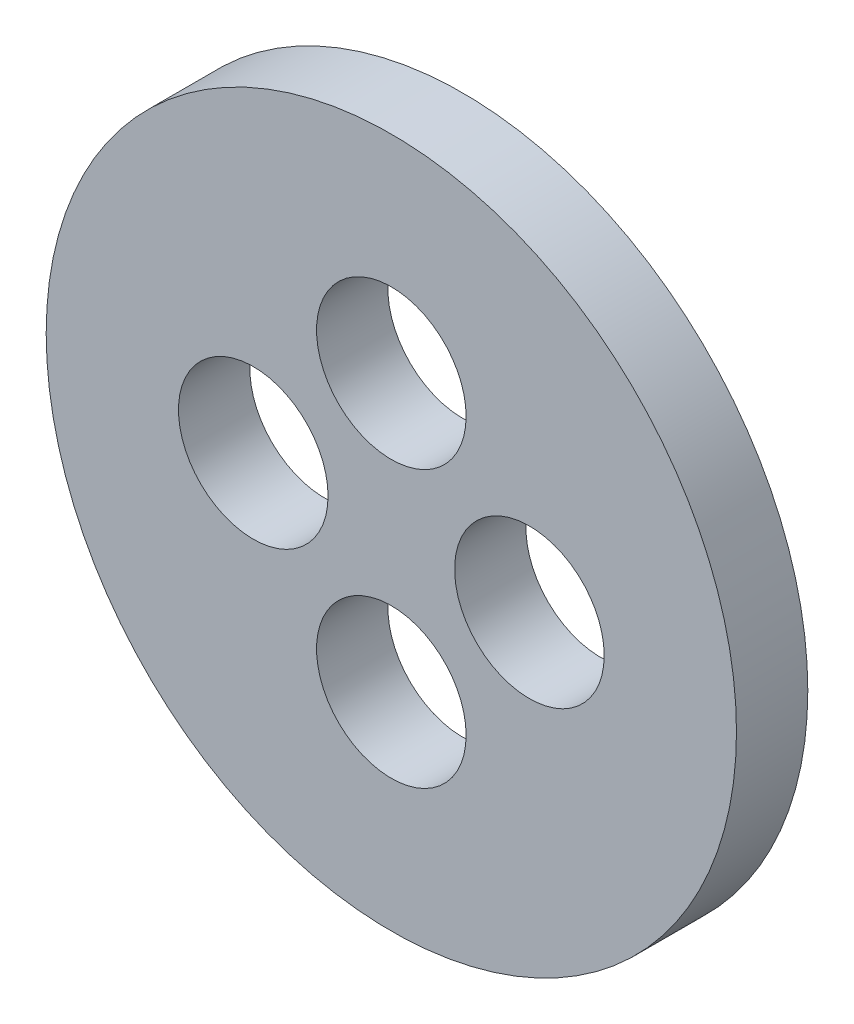
ISO-10303-21;
HEADER;
FILE_DESCRIPTION(('STEP AP214'),'2;1');
FILE_NAME('part.step','',(''),(''),'','','');
FILE_SCHEMA(('AUTOMOTIVE_DESIGN { 1 0 10303 214 1 1 1 1 }'));
ENDSEC;
DATA;
#1=APPLICATION_CONTEXT('core data for automotive mechanical design processes');
#2=APPLICATION_PROTOCOL_DEFINITION('international standard','automotive_design',2000,#1);
#3=PRODUCT_CONTEXT('',#1,'mechanical');
#4=PRODUCT('Part','Part','',(#3));
#5=PRODUCT_RELATED_PRODUCT_CATEGORY('part','',(#4));
#6=PRODUCT_DEFINITION_FORMATION('','',#4);
#7=PRODUCT_DEFINITION_CONTEXT('part definition',#1,'design');
#8=PRODUCT_DEFINITION('design','',#6,#7);
#9=PRODUCT_DEFINITION_SHAPE('','',#8);
#10=(LENGTH_UNIT() NAMED_UNIT(*) SI_UNIT(.MILLI.,.METRE.));
#11=(NAMED_UNIT(*) PLANE_ANGLE_UNIT() SI_UNIT($,.RADIAN.));
#12=(NAMED_UNIT(*) SI_UNIT($,.STERADIAN.) SOLID_ANGLE_UNIT());
#13=UNCERTAINTY_MEASURE_WITH_UNIT(LENGTH_MEASURE(1.E-05),#10,'distance_accuracy_value','');
#14=(GEOMETRIC_REPRESENTATION_CONTEXT(3) GLOBAL_UNCERTAINTY_ASSIGNED_CONTEXT((#13)) GLOBAL_UNIT_ASSIGNED_CONTEXT((#10,
#11,#12)) REPRESENTATION_CONTEXT('',''));
#15=CARTESIAN_POINT('',(0.,0.,0.));
#16=DIRECTION('',(0.,0.,1.));
#17=DIRECTION('',(1.,0.,0.));
#18=AXIS2_PLACEMENT_3D('',#15,#16,#17);
#19=CARTESIAN_POINT('',(0.,0.,3.1));
#20=DIRECTION('',(0.,0.,1.));
#21=DIRECTION('',(1.,0.,0.));
#22=AXIS2_PLACEMENT_3D('',#19,#20,#21);
#23=PLANE('',#22);
#24=CARTESIAN_POINT('',(6.,0.,3.1));
#25=DIRECTION('',(0.,0.,1.));
#26=DIRECTION('',(1.,0.,0.));
#27=AXIS2_PLACEMENT_3D('',#24,#25,#26);
#28=CIRCLE('',#27,3.25);
#29=CARTESIAN_POINT('',(9.25,0.,3.1));
#30=VERTEX_POINT('',#29);
#31=EDGE_CURVE('E46',#30,#30,#28,.T.);
#32=ORIENTED_EDGE('',*,*,#31,.F.);
#33=EDGE_LOOP('',(#32));
#34=FACE_BOUND('',#33,.T.);
#35=CARTESIAN_POINT('',(-6.,0.,3.1));
#36=DIRECTION('',(0.,0.,1.));
#37=DIRECTION('',(1.,0.,0.));
#38=AXIS2_PLACEMENT_3D('',#35,#36,#37);
#39=CIRCLE('',#38,3.25);
#40=CARTESIAN_POINT('',(-2.75,0.,3.1));
#41=VERTEX_POINT('',#40);
#42=EDGE_CURVE('E10',#41,#41,#39,.T.);
#43=ORIENTED_EDGE('',*,*,#42,.F.);
#44=EDGE_LOOP('',(#43));
#45=FACE_BOUND('',#44,.T.);
#46=CARTESIAN_POINT('',(0.,6.,3.1));
#47=DIRECTION('',(0.,0.,1.));
#48=DIRECTION('',(1.,0.,0.));
#49=AXIS2_PLACEMENT_3D('',#46,#47,#48);
#50=CIRCLE('',#49,3.25);
#51=CARTESIAN_POINT('',(3.25,6.,3.1));
#52=VERTEX_POINT('',#51);
#53=EDGE_CURVE('E41',#52,#52,#50,.T.);
#54=ORIENTED_EDGE('',*,*,#53,.F.);
#55=EDGE_LOOP('',(#54));
#56=FACE_BOUND('',#55,.T.);
#57=CARTESIAN_POINT('',(0.,-6.,3.1));
#58=DIRECTION('',(0.,0.,1.));
#59=DIRECTION('',(1.,0.,0.));
#60=AXIS2_PLACEMENT_3D('',#57,#58,#59);
#61=CIRCLE('',#60,3.25);
#62=CARTESIAN_POINT('',(3.25,-6.,3.1));
#63=VERTEX_POINT('',#62);
#64=EDGE_CURVE('E52',#63,#63,#61,.T.);
#65=ORIENTED_EDGE('',*,*,#64,.F.);
#66=EDGE_LOOP('',(#65));
#67=FACE_BOUND('',#66,.T.);
#68=CARTESIAN_POINT('',(0.,0.,3.1));
#69=DIRECTION('',(0.,0.,1.));
#70=DIRECTION('',(1.,0.,0.));
#71=AXIS2_PLACEMENT_3D('',#68,#69,#70);
#72=CIRCLE('',#71,15.);
#73=CARTESIAN_POINT('',(15.,0.,3.1));
#74=VERTEX_POINT('',#73);
#75=EDGE_CURVE('E61',#74,#74,#72,.T.);
#76=ORIENTED_EDGE('',*,*,#75,.T.);
#77=EDGE_LOOP('',(#76));
#78=FACE_BOUND('',#77,.T.);
#79=ADVANCED_FACE('F30',(#34,#45,#56,#67,#78),#23,.T.);
#80=CARTESIAN_POINT('',(0.,0.,0.));
#81=DIRECTION('',(0.,0.,1.));
#82=DIRECTION('',(1.,0.,0.));
#83=AXIS2_PLACEMENT_3D('',#80,#81,#82);
#84=PLANE('',#83);
#85=CARTESIAN_POINT('',(6.,0.,0.));
#86=DIRECTION('',(0.,0.,1.));
#87=DIRECTION('',(1.,0.,0.));
#88=AXIS2_PLACEMENT_3D('',#85,#86,#87);
#89=CIRCLE('',#88,3.25);
#90=CARTESIAN_POINT('',(9.25,0.,0.));
#91=VERTEX_POINT('',#90);
#92=EDGE_CURVE('E49',#91,#91,#89,.T.);
#93=ORIENTED_EDGE('',*,*,#92,.T.);
#94=EDGE_LOOP('',(#93));
#95=FACE_BOUND('',#94,.T.);
#96=CARTESIAN_POINT('',(-6.,0.,0.));
#97=DIRECTION('',(0.,0.,1.));
#98=DIRECTION('',(1.,0.,0.));
#99=AXIS2_PLACEMENT_3D('',#96,#97,#98);
#100=CIRCLE('',#99,3.25);
#101=CARTESIAN_POINT('',(-2.75,0.,0.));
#102=VERTEX_POINT('',#101);
#103=EDGE_CURVE('E34',#102,#102,#100,.T.);
#104=ORIENTED_EDGE('',*,*,#103,.T.);
#105=EDGE_LOOP('',(#104));
#106=FACE_BOUND('',#105,.T.);
#107=CARTESIAN_POINT('',(0.,6.,0.));
#108=DIRECTION('',(0.,0.,1.));
#109=DIRECTION('',(1.,0.,0.));
#110=AXIS2_PLACEMENT_3D('',#107,#108,#109);
#111=CIRCLE('',#110,3.25);
#112=CARTESIAN_POINT('',(3.25,6.,0.));
#113=VERTEX_POINT('',#112);
#114=EDGE_CURVE('E43',#113,#113,#111,.T.);
#115=ORIENTED_EDGE('',*,*,#114,.T.);
#116=EDGE_LOOP('',(#115));
#117=FACE_BOUND('',#116,.T.);
#118=CARTESIAN_POINT('',(0.,-6.,0.));
#119=DIRECTION('',(0.,0.,1.));
#120=DIRECTION('',(1.,0.,0.));
#121=AXIS2_PLACEMENT_3D('',#118,#119,#120);
#122=CIRCLE('',#121,3.25);
#123=CARTESIAN_POINT('',(3.25,-6.,0.));
#124=VERTEX_POINT('',#123);
#125=EDGE_CURVE('E55',#124,#124,#122,.T.);
#126=ORIENTED_EDGE('',*,*,#125,.T.);
#127=EDGE_LOOP('',(#126));
#128=FACE_BOUND('',#127,.T.);
#129=CARTESIAN_POINT('',(0.,0.,0.));
#130=DIRECTION('',(0.,0.,1.));
#131=DIRECTION('',(1.,0.,0.));
#132=AXIS2_PLACEMENT_3D('',#129,#130,#131);
#133=CIRCLE('',#132,15.);
#134=CARTESIAN_POINT('',(15.,0.,0.));
#135=VERTEX_POINT('',#134);
#136=EDGE_CURVE('E58',#135,#135,#133,.T.);
#137=ORIENTED_EDGE('',*,*,#136,.F.);
#138=EDGE_LOOP('',(#137));
#139=FACE_BOUND('',#138,.T.);
#140=ADVANCED_FACE('F32',(#95,#106,#117,#128,#139),#84,.F.);
#141=CARTESIAN_POINT('',(-6.,0.,3.1));
#142=DIRECTION('',(0.,0.,-1.));
#143=DIRECTION('',(-1.,0.,0.));
#144=AXIS2_PLACEMENT_3D('',#141,#142,#143);
#145=CYLINDRICAL_SURFACE('',#144,3.25);
#146=ORIENTED_EDGE('',*,*,#42,.T.);
#147=EDGE_LOOP('',(#146));
#148=FACE_BOUND('',#147,.T.);
#149=ORIENTED_EDGE('',*,*,#103,.F.);
#150=EDGE_LOOP('',(#149));
#151=FACE_BOUND('',#150,.T.);
#152=ADVANCED_FACE('F71',(#148,#151),#145,.F.);
#153=CARTESIAN_POINT('',(0.,6.,3.1));
#154=DIRECTION('',(0.,0.,-1.));
#155=DIRECTION('',(-1.,0.,0.));
#156=AXIS2_PLACEMENT_3D('',#153,#154,#155);
#157=CYLINDRICAL_SURFACE('',#156,3.25);
#158=ORIENTED_EDGE('',*,*,#53,.T.);
#159=EDGE_LOOP('',(#158));
#160=FACE_BOUND('',#159,.T.);
#161=ORIENTED_EDGE('',*,*,#114,.F.);
#162=EDGE_LOOP('',(#161));
#163=FACE_BOUND('',#162,.T.);
#164=ADVANCED_FACE('F77',(#160,#163),#157,.F.);
#165=CARTESIAN_POINT('',(6.,0.,3.1));
#166=DIRECTION('',(0.,0.,-1.));
#167=DIRECTION('',(-1.,0.,0.));
#168=AXIS2_PLACEMENT_3D('',#165,#166,#167);
#169=CYLINDRICAL_SURFACE('',#168,3.25);
#170=ORIENTED_EDGE('',*,*,#31,.T.);
#171=EDGE_LOOP('',(#170));
#172=FACE_BOUND('',#171,.T.);
#173=ORIENTED_EDGE('',*,*,#92,.F.);
#174=EDGE_LOOP('',(#173));
#175=FACE_BOUND('',#174,.T.);
#176=ADVANCED_FACE('F90',(#172,#175),#169,.F.);
#177=CARTESIAN_POINT('',(0.,-6.,3.1));
#178=DIRECTION('',(0.,0.,-1.));
#179=DIRECTION('',(-1.,0.,0.));
#180=AXIS2_PLACEMENT_3D('',#177,#178,#179);
#181=CYLINDRICAL_SURFACE('',#180,3.25);
#182=ORIENTED_EDGE('',*,*,#64,.T.);
#183=EDGE_LOOP('',(#182));
#184=FACE_BOUND('',#183,.T.);
#185=ORIENTED_EDGE('',*,*,#125,.F.);
#186=EDGE_LOOP('',(#185));
#187=FACE_BOUND('',#186,.T.);
#188=ADVANCED_FACE('F88',(#184,#187),#181,.F.);
#189=CARTESIAN_POINT('',(0.,0.,0.));
#190=DIRECTION('',(0.,0.,1.));
#191=DIRECTION('',(1.,0.,0.));
#192=AXIS2_PLACEMENT_3D('',#189,#190,#191);
#193=CYLINDRICAL_SURFACE('',#192,15.);
#194=ORIENTED_EDGE('',*,*,#136,.T.);
#195=EDGE_LOOP('',(#194));
#196=FACE_BOUND('',#195,.T.);
#197=ORIENTED_EDGE('',*,*,#75,.F.);
#198=EDGE_LOOP('',(#197));
#199=FACE_BOUND('',#198,.T.);
#200=ADVANCED_FACE('F67',(#196,#199),#193,.T.);
#201=CLOSED_SHELL('',(#79,#140,#152,#164,#176,#188,#200));
#202=MANIFOLD_SOLID_BREP('B2',#201);
#203=ADVANCED_BREP_SHAPE_REPRESENTATION('',(#18,#202),#14);
#204=SHAPE_DEFINITION_REPRESENTATION(#9,#203);
ENDSEC;
END-ISO-10303-21;
